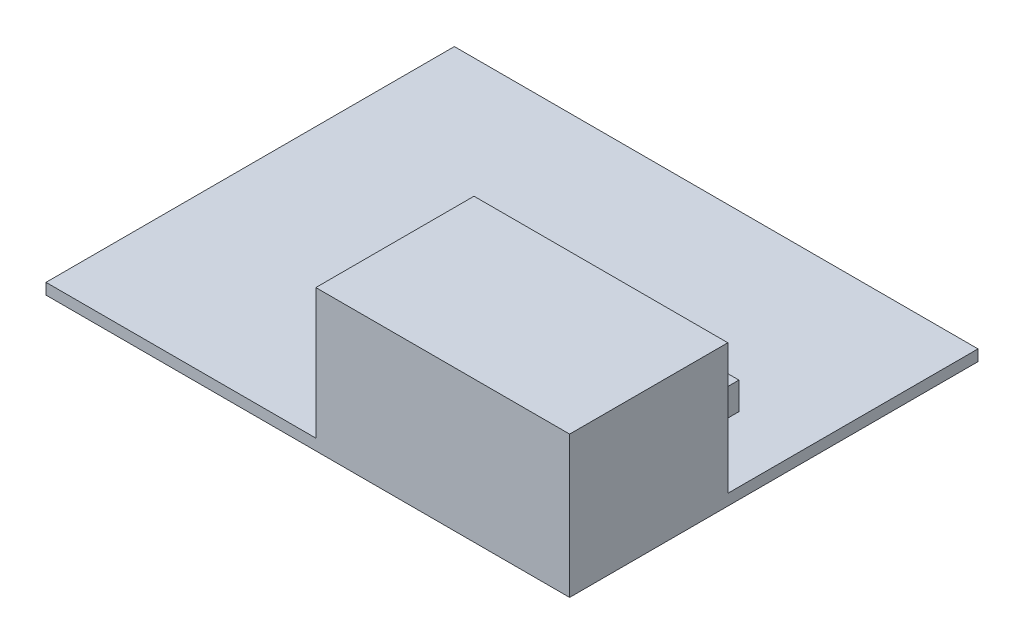
ISO-10303-21;
HEADER;
FILE_DESCRIPTION(('STEP AP214'),'2;1');
FILE_NAME('part.step','',(''),(''),'','','');
FILE_SCHEMA(('AUTOMOTIVE_DESIGN { 1 0 10303 214 1 1 1 1 }'));
ENDSEC;
DATA;
#1=APPLICATION_CONTEXT('core data for automotive mechanical design processes');
#2=APPLICATION_PROTOCOL_DEFINITION('international standard','automotive_design',2000,#1);
#3=PRODUCT_CONTEXT('',#1,'mechanical');
#4=PRODUCT('Part','Part','',(#3));
#5=PRODUCT_RELATED_PRODUCT_CATEGORY('part','',(#4));
#6=PRODUCT_DEFINITION_FORMATION('','',#4);
#7=PRODUCT_DEFINITION_CONTEXT('part definition',#1,'design');
#8=PRODUCT_DEFINITION('design','',#6,#7);
#9=PRODUCT_DEFINITION_SHAPE('','',#8);
#10=(LENGTH_UNIT() NAMED_UNIT(*) SI_UNIT(.MILLI.,.METRE.));
#11=(NAMED_UNIT(*) PLANE_ANGLE_UNIT() SI_UNIT($,.RADIAN.));
#12=(NAMED_UNIT(*) SI_UNIT($,.STERADIAN.) SOLID_ANGLE_UNIT());
#13=UNCERTAINTY_MEASURE_WITH_UNIT(LENGTH_MEASURE(1.E-05),#10,'distance_accuracy_value','');
#14=(GEOMETRIC_REPRESENTATION_CONTEXT(3) GLOBAL_UNCERTAINTY_ASSIGNED_CONTEXT((#13)) GLOBAL_UNIT_ASSIGNED_CONTEXT((#10,
#11,#12)) REPRESENTATION_CONTEXT('',''));
#15=CARTESIAN_POINT('',(0.,0.,0.));
#16=DIRECTION('',(0.,0.,1.));
#17=DIRECTION('',(1.,0.,0.));
#18=AXIS2_PLACEMENT_3D('',#15,#16,#17);
#19=CARTESIAN_POINT('',(0.,1.62,0.));
#20=DIRECTION('',(0.,1.,0.));
#21=DIRECTION('',(0.,0.,1.));
#22=AXIS2_PLACEMENT_3D('',#19,#20,#21);
#23=PLANE('',#22);
#24=DIRECTION('',(0.,0.,1.));
#25=VECTOR('',#24,1.);
#26=CARTESIAN_POINT('',(1.16839999999999,1.62,29.8323));
#27=LINE('',#26,#25);
#28=CARTESIAN_POINT('',(1.16839999999999,1.62,6.71829999999999));
#29=VERTEX_POINT('',#28);
#30=CARTESIAN_POINT('',(1.16839999999999,1.62,29.8323));
#31=VERTEX_POINT('',#30);
#32=EDGE_CURVE('E146',#29,#31,#27,.T.);
#33=ORIENTED_EDGE('',*,*,#32,.F.);
#34=DIRECTION('',(-1.,0.,0.));
#35=VECTOR('',#34,1.);
#36=CARTESIAN_POINT('',(38.2524,1.62,6.71829999999999));
#37=LINE('',#36,#35);
#38=CARTESIAN_POINT('',(38.2524,1.62,6.71829999999999));
#39=VERTEX_POINT('',#38);
#40=EDGE_CURVE('E60',#39,#29,#37,.T.);
#41=ORIENTED_EDGE('',*,*,#40,.F.);
#42=DIRECTION('',(0.,0.,-1.));
#43=VECTOR('',#42,1.);
#44=CARTESIAN_POINT('',(38.2524,1.62,29.8323));
#45=LINE('',#44,#43);
#46=CARTESIAN_POINT('',(38.2524,1.62,-29.8323));
#47=VERTEX_POINT('',#46);
#48=EDGE_CURVE('E190',#39,#47,#45,.T.);
#49=ORIENTED_EDGE('',*,*,#48,.T.);
#50=DIRECTION('',(-1.,0.,0.));
#51=VECTOR('',#50,1.);
#52=CARTESIAN_POINT('',(38.2524,1.62,-29.8323));
#53=LINE('',#52,#51);
#54=CARTESIAN_POINT('',(-38.2524,1.62,-29.8323));
#55=VERTEX_POINT('',#54);
#56=EDGE_CURVE('E193',#47,#55,#53,.T.);
#57=ORIENTED_EDGE('',*,*,#56,.T.);
#58=DIRECTION('',(0.,0.,1.));
#59=VECTOR('',#58,1.);
#60=CARTESIAN_POINT('',(-38.2524,1.62,29.8323));
#61=LINE('',#60,#59);
#62=CARTESIAN_POINT('',(-38.2524,1.62,29.8323));
#63=VERTEX_POINT('',#62);
#64=EDGE_CURVE('E206',#55,#63,#61,.T.);
#65=ORIENTED_EDGE('',*,*,#64,.T.);
#66=DIRECTION('',(1.,0.,0.));
#67=VECTOR('',#66,1.);
#68=CARTESIAN_POINT('',(38.2524,1.62,29.8323));
#69=LINE('',#68,#67);
#70=EDGE_CURVE('E194',#63,#31,#69,.T.);
#71=ORIENTED_EDGE('',*,*,#70,.T.);
#72=EDGE_LOOP('',(#33,#41,#49,#57,#65,#71));
#73=FACE_BOUND('',#72,.T.);
#74=DIRECTION('',(1.,0.,0.));
#75=VECTOR('',#74,1.);
#76=CARTESIAN_POINT('',(28.733800870763,1.62,0.582851763640785));
#77=LINE('',#76,#75);
#78=CARTESIAN_POINT('',(22.3709991292369,1.62,0.582851763640786));
#79=VERTEX_POINT('',#78);
#80=CARTESIAN_POINT('',(28.733800870763,1.62,0.582851763640785));
#81=VERTEX_POINT('',#80);
#82=EDGE_CURVE('E358',#79,#81,#77,.T.);
#83=ORIENTED_EDGE('',*,*,#82,.F.);
#84=DIRECTION('',(0.,0.,1.));
#85=VECTOR('',#84,1.);
#86=CARTESIAN_POINT('',(22.3709991292369,1.62,0.582851763640786));
#87=LINE('',#86,#85);
#88=CARTESIAN_POINT('',(22.3709991292369,1.62,-4.4182517636408));
#89=VERTEX_POINT('',#88);
#90=EDGE_CURVE('E143',#89,#79,#87,.T.);
#91=ORIENTED_EDGE('',*,*,#90,.F.);
#92=DIRECTION('',(-1.,0.,0.));
#93=VECTOR('',#92,1.);
#94=CARTESIAN_POINT('',(28.733800870763,1.62,-4.4182517636408));
#95=LINE('',#94,#93);
#96=CARTESIAN_POINT('',(28.733800870763,1.62,-4.4182517636408));
#97=VERTEX_POINT('',#96);
#98=EDGE_CURVE('E139',#97,#89,#95,.T.);
#99=ORIENTED_EDGE('',*,*,#98,.F.);
#100=DIRECTION('',(0.,0.,-1.));
#101=VECTOR('',#100,1.);
#102=CARTESIAN_POINT('',(28.733800870763,1.62,0.582851763640785));
#103=LINE('',#102,#101);
#104=EDGE_CURVE('E355',#81,#97,#103,.T.);
#105=ORIENTED_EDGE('',*,*,#104,.F.);
#106=EDGE_LOOP('',(#83,#91,#99,#105));
#107=FACE_BOUND('',#106,.T.);
#108=ADVANCED_FACE('F35',(#73,#107),#23,.T.);
#109=CARTESIAN_POINT('',(-38.2524,1.62,29.8323));
#110=DIRECTION('',(1.,0.,0.));
#111=DIRECTION('',(0.,0.,-1.));
#112=AXIS2_PLACEMENT_3D('',#109,#110,#111);
#113=PLANE('',#112);
#114=DIRECTION('',(0.,0.,1.));
#115=VECTOR('',#114,1.);
#116=CARTESIAN_POINT('',(-38.2524,0.,29.8323));
#117=LINE('',#116,#115);
#118=CARTESIAN_POINT('',(-38.2524,0.,-29.8323));
#119=VERTEX_POINT('',#118);
#120=CARTESIAN_POINT('',(-38.2524,0.,29.8323));
#121=VERTEX_POINT('',#120);
#122=EDGE_CURVE('E181',#119,#121,#117,.T.);
#123=ORIENTED_EDGE('',*,*,#122,.T.);
#124=DIRECTION('',(0.,-1.,0.));
#125=VECTOR('',#124,1.);
#126=CARTESIAN_POINT('',(-38.2524,1.62,29.8323));
#127=LINE('',#126,#125);
#128=EDGE_CURVE('E11',#63,#121,#127,.T.);
#129=ORIENTED_EDGE('',*,*,#128,.F.);
#130=ORIENTED_EDGE('',*,*,#64,.F.);
#131=DIRECTION('',(0.,-1.,0.));
#132=VECTOR('',#131,1.);
#133=CARTESIAN_POINT('',(-38.2524,1.62,-29.8323));
#134=LINE('',#133,#132);
#135=EDGE_CURVE('E199',#55,#119,#134,.T.);
#136=ORIENTED_EDGE('',*,*,#135,.T.);
#137=EDGE_LOOP('',(#123,#129,#130,#136));
#138=FACE_BOUND('',#137,.T.);
#139=ADVANCED_FACE('F37',(#138),#113,.F.);
#140=CARTESIAN_POINT('',(38.2524,1.62,29.8323));
#141=DIRECTION('',(0.,0.,-1.));
#142=DIRECTION('',(-1.,0.,0.));
#143=AXIS2_PLACEMENT_3D('',#140,#141,#142);
#144=PLANE('',#143);
#145=DIRECTION('',(1.,0.,0.));
#146=VECTOR('',#145,1.);
#147=CARTESIAN_POINT('',(38.2524,0.,29.8323));
#148=LINE('',#147,#146);
#149=CARTESIAN_POINT('',(38.2524,0.,29.8323));
#150=VERTEX_POINT('',#149);
#151=EDGE_CURVE('E185',#121,#150,#148,.T.);
#152=ORIENTED_EDGE('',*,*,#151,.T.);
#153=DIRECTION('',(0.,-1.,0.));
#154=VECTOR('',#153,1.);
#155=CARTESIAN_POINT('',(38.2524,1.62,29.8323));
#156=LINE('',#155,#154);
#157=CARTESIAN_POINT('',(38.2524,20.67,29.8323));
#158=VERTEX_POINT('',#157);
#159=EDGE_CURVE('E44',#158,#150,#156,.T.);
#160=ORIENTED_EDGE('',*,*,#159,.F.);
#161=DIRECTION('',(1.,0.,0.));
#162=VECTOR('',#161,1.);
#163=CARTESIAN_POINT('',(38.2524,20.67,29.8323));
#164=LINE('',#163,#162);
#165=CARTESIAN_POINT('',(1.16839999999999,20.67,29.8323));
#166=VERTEX_POINT('',#165);
#167=EDGE_CURVE('E158',#166,#158,#164,.T.);
#168=ORIENTED_EDGE('',*,*,#167,.F.);
#169=DIRECTION('',(0.,-1.,0.));
#170=VECTOR('',#169,1.);
#171=CARTESIAN_POINT('',(1.16839999999999,20.67,29.8323));
#172=LINE('',#171,#170);
#173=EDGE_CURVE('E161',#166,#31,#172,.T.);
#174=ORIENTED_EDGE('',*,*,#173,.T.);
#175=ORIENTED_EDGE('',*,*,#70,.F.);
#176=ORIENTED_EDGE('',*,*,#128,.T.);
#177=EDGE_LOOP('',(#152,#160,#168,#174,#175,#176));
#178=FACE_BOUND('',#177,.T.);
#179=ADVANCED_FACE('F232',(#178),#144,.F.);
#180=CARTESIAN_POINT('',(38.2524,1.62,29.8323));
#181=DIRECTION('',(-1.,0.,0.));
#182=DIRECTION('',(0.,0.,1.));
#183=AXIS2_PLACEMENT_3D('',#180,#181,#182);
#184=PLANE('',#183);
#185=DIRECTION('',(0.,0.,-1.));
#186=VECTOR('',#185,1.);
#187=CARTESIAN_POINT('',(38.2524,0.,29.8323));
#188=LINE('',#187,#186);
#189=CARTESIAN_POINT('',(38.2524,0.,-29.8323));
#190=VERTEX_POINT('',#189);
#191=EDGE_CURVE('E202',#150,#190,#188,.T.);
#192=ORIENTED_EDGE('',*,*,#191,.T.);
#193=DIRECTION('',(0.,-1.,0.));
#194=VECTOR('',#193,1.);
#195=CARTESIAN_POINT('',(38.2524,1.62,-29.8323));
#196=LINE('',#195,#194);
#197=EDGE_CURVE('E209',#47,#190,#196,.T.);
#198=ORIENTED_EDGE('',*,*,#197,.F.);
#199=ORIENTED_EDGE('',*,*,#48,.F.);
#200=DIRECTION('',(0.,-1.,0.));
#201=VECTOR('',#200,1.);
#202=CARTESIAN_POINT('',(38.2524,20.67,6.71829999999999));
#203=LINE('',#202,#201);
#204=CARTESIAN_POINT('',(38.2524,20.67,6.71829999999999));
#205=VERTEX_POINT('',#204);
#206=EDGE_CURVE('E176',#205,#39,#203,.T.);
#207=ORIENTED_EDGE('',*,*,#206,.F.);
#208=DIRECTION('',(0.,0.,-1.));
#209=VECTOR('',#208,1.);
#210=CARTESIAN_POINT('',(38.2524,20.67,29.8323));
#211=LINE('',#210,#209);
#212=EDGE_CURVE('E151',#158,#205,#211,.T.);
#213=ORIENTED_EDGE('',*,*,#212,.F.);
#214=ORIENTED_EDGE('',*,*,#159,.T.);
#215=EDGE_LOOP('',(#192,#198,#199,#207,#213,#214));
#216=FACE_BOUND('',#215,.T.);
#217=ADVANCED_FACE('F216',(#216),#184,.F.);
#218=CARTESIAN_POINT('',(38.2524,1.62,-29.8323));
#219=DIRECTION('',(0.,0.,1.));
#220=DIRECTION('',(1.,0.,0.));
#221=AXIS2_PLACEMENT_3D('',#218,#219,#220);
#222=PLANE('',#221);
#223=DIRECTION('',(-1.,0.,0.));
#224=VECTOR('',#223,1.);
#225=CARTESIAN_POINT('',(38.2524,0.,-29.8323));
#226=LINE('',#225,#224);
#227=EDGE_CURVE('E204',#190,#119,#226,.T.);
#228=ORIENTED_EDGE('',*,*,#227,.T.);
#229=ORIENTED_EDGE('',*,*,#135,.F.);
#230=ORIENTED_EDGE('',*,*,#56,.F.);
#231=ORIENTED_EDGE('',*,*,#197,.T.);
#232=EDGE_LOOP('',(#228,#229,#230,#231));
#233=FACE_BOUND('',#232,.T.);
#234=ADVANCED_FACE('F224',(#233),#222,.F.);
#235=CARTESIAN_POINT('',(0.,0.,0.));
#236=DIRECTION('',(0.,1.,0.));
#237=DIRECTION('',(0.,0.,1.));
#238=AXIS2_PLACEMENT_3D('',#235,#236,#237);
#239=PLANE('',#238);
#240=ORIENTED_EDGE('',*,*,#122,.F.);
#241=ORIENTED_EDGE('',*,*,#227,.F.);
#242=ORIENTED_EDGE('',*,*,#191,.F.);
#243=ORIENTED_EDGE('',*,*,#151,.F.);
#244=EDGE_LOOP('',(#240,#241,#242,#243));
#245=FACE_BOUND('',#244,.T.);
#246=ADVANCED_FACE('F221',(#245),#239,.F.);
#247=CARTESIAN_POINT('',(38.2524,20.67,6.71829999999999));
#248=DIRECTION('',(0.,0.,1.));
#249=DIRECTION('',(1.,0.,0.));
#250=AXIS2_PLACEMENT_3D('',#247,#248,#249);
#251=PLANE('',#250);
#252=ORIENTED_EDGE('',*,*,#40,.T.);
#253=DIRECTION('',(0.,-1.,0.));
#254=VECTOR('',#253,1.);
#255=CARTESIAN_POINT('',(1.16839999999999,20.67,6.71829999999999));
#256=LINE('',#255,#254);
#257=CARTESIAN_POINT('',(1.16839999999999,20.67,6.71829999999999));
#258=VERTEX_POINT('',#257);
#259=EDGE_CURVE('E164',#258,#29,#256,.T.);
#260=ORIENTED_EDGE('',*,*,#259,.F.);
#261=DIRECTION('',(-1.,0.,0.));
#262=VECTOR('',#261,1.);
#263=CARTESIAN_POINT('',(38.2524,20.67,6.71829999999999));
#264=LINE('',#263,#262);
#265=EDGE_CURVE('E154',#205,#258,#264,.T.);
#266=ORIENTED_EDGE('',*,*,#265,.F.);
#267=ORIENTED_EDGE('',*,*,#206,.T.);
#268=EDGE_LOOP('',(#252,#260,#266,#267));
#269=FACE_BOUND('',#268,.T.);
#270=ADVANCED_FACE('F235',(#269),#251,.F.);
#271=CARTESIAN_POINT('',(1.16839999999999,20.67,29.8323));
#272=DIRECTION('',(1.,0.,0.));
#273=DIRECTION('',(0.,0.,-1.));
#274=AXIS2_PLACEMENT_3D('',#271,#272,#273);
#275=PLANE('',#274);
#276=ORIENTED_EDGE('',*,*,#32,.T.);
#277=ORIENTED_EDGE('',*,*,#173,.F.);
#278=DIRECTION('',(0.,0.,1.));
#279=VECTOR('',#278,1.);
#280=CARTESIAN_POINT('',(1.16839999999999,20.67,29.8323));
#281=LINE('',#280,#279);
#282=EDGE_CURVE('E156',#258,#166,#281,.T.);
#283=ORIENTED_EDGE('',*,*,#282,.F.);
#284=ORIENTED_EDGE('',*,*,#259,.T.);
#285=EDGE_LOOP('',(#276,#277,#283,#284));
#286=FACE_BOUND('',#285,.T.);
#287=ADVANCED_FACE('F231',(#286),#275,.F.);
#288=CARTESIAN_POINT('',(0.,20.67,0.));
#289=DIRECTION('',(0.,1.,0.));
#290=DIRECTION('',(0.,0.,1.));
#291=AXIS2_PLACEMENT_3D('',#288,#289,#290);
#292=PLANE('',#291);
#293=ORIENTED_EDGE('',*,*,#212,.T.);
#294=ORIENTED_EDGE('',*,*,#265,.T.);
#295=ORIENTED_EDGE('',*,*,#282,.T.);
#296=ORIENTED_EDGE('',*,*,#167,.T.);
#297=EDGE_LOOP('',(#293,#294,#295,#296));
#298=FACE_BOUND('',#297,.T.);
#299=ADVANCED_FACE('F234',(#298),#292,.T.);
#300=CARTESIAN_POINT('',(22.3709991292369,5.62,0.582851763640786));
#301=DIRECTION('',(1.,0.,0.));
#302=DIRECTION('',(0.,0.,-1.));
#303=AXIS2_PLACEMENT_3D('',#300,#301,#302);
#304=PLANE('',#303);
#305=ORIENTED_EDGE('',*,*,#90,.T.);
#306=DIRECTION('',(0.,-1.,0.));
#307=VECTOR('',#306,1.);
#308=CARTESIAN_POINT('',(22.3709991292369,5.62,0.582851763640786));
#309=LINE('',#308,#307);
#310=CARTESIAN_POINT('',(22.3709991292369,5.62,0.582851763640786));
#311=VERTEX_POINT('',#310);
#312=EDGE_CURVE('E124',#311,#79,#309,.T.);
#313=ORIENTED_EDGE('',*,*,#312,.F.);
#314=DIRECTION('',(0.,0.,1.));
#315=VECTOR('',#314,1.);
#316=CARTESIAN_POINT('',(22.3709991292369,5.62,0.582851763640786));
#317=LINE('',#316,#315);
#318=CARTESIAN_POINT('',(22.3709991292369,5.62,-4.4182517636408));
#319=VERTEX_POINT('',#318);
#320=EDGE_CURVE('E131',#319,#311,#317,.T.);
#321=ORIENTED_EDGE('',*,*,#320,.F.);
#322=DIRECTION('',(0.,-1.,0.));
#323=VECTOR('',#322,1.);
#324=CARTESIAN_POINT('',(22.3709991292369,5.62,-4.4182517636408));
#325=LINE('',#324,#323);
#326=EDGE_CURVE('E353',#319,#89,#325,.T.);
#327=ORIENTED_EDGE('',*,*,#326,.T.);
#328=EDGE_LOOP('',(#305,#313,#321,#327));
#329=FACE_BOUND('',#328,.T.);
#330=ADVANCED_FACE('F141',(#329),#304,.F.);
#331=CARTESIAN_POINT('',(28.733800870763,5.62,0.582851763640785));
#332=DIRECTION('',(0.,0.,-1.));
#333=DIRECTION('',(-1.,0.,0.));
#334=AXIS2_PLACEMENT_3D('',#331,#332,#333);
#335=PLANE('',#334);
#336=ORIENTED_EDGE('',*,*,#82,.T.);
#337=DIRECTION('',(0.,-1.,0.));
#338=VECTOR('',#337,1.);
#339=CARTESIAN_POINT('',(28.733800870763,5.62,0.582851763640785));
#340=LINE('',#339,#338);
#341=CARTESIAN_POINT('',(28.733800870763,5.62,0.582851763640785));
#342=VERTEX_POINT('',#341);
#343=EDGE_CURVE('E127',#342,#81,#340,.T.);
#344=ORIENTED_EDGE('',*,*,#343,.F.);
#345=DIRECTION('',(1.,0.,0.));
#346=VECTOR('',#345,1.);
#347=CARTESIAN_POINT('',(28.733800870763,5.62,0.582851763640785));
#348=LINE('',#347,#346);
#349=EDGE_CURVE('E120',#311,#342,#348,.T.);
#350=ORIENTED_EDGE('',*,*,#349,.F.);
#351=ORIENTED_EDGE('',*,*,#312,.T.);
#352=EDGE_LOOP('',(#336,#344,#350,#351));
#353=FACE_BOUND('',#352,.T.);
#354=ADVANCED_FACE('F122',(#353),#335,.F.);
#355=CARTESIAN_POINT('',(28.733800870763,5.62,0.582851763640785));
#356=DIRECTION('',(-1.,0.,0.));
#357=DIRECTION('',(0.,0.,1.));
#358=AXIS2_PLACEMENT_3D('',#355,#356,#357);
#359=PLANE('',#358);
#360=ORIENTED_EDGE('',*,*,#104,.T.);
#361=DIRECTION('',(0.,-1.,0.));
#362=VECTOR('',#361,1.);
#363=CARTESIAN_POINT('',(28.733800870763,5.62,-4.4182517636408));
#364=LINE('',#363,#362);
#365=CARTESIAN_POINT('',(28.733800870763,5.62,-4.4182517636408));
#366=VERTEX_POINT('',#365);
#367=EDGE_CURVE('E52',#366,#97,#364,.T.);
#368=ORIENTED_EDGE('',*,*,#367,.F.);
#369=DIRECTION('',(0.,0.,-1.));
#370=VECTOR('',#369,1.);
#371=CARTESIAN_POINT('',(28.733800870763,5.62,0.582851763640785));
#372=LINE('',#371,#370);
#373=EDGE_CURVE('E130',#342,#366,#372,.T.);
#374=ORIENTED_EDGE('',*,*,#373,.F.);
#375=ORIENTED_EDGE('',*,*,#343,.T.);
#376=EDGE_LOOP('',(#360,#368,#374,#375));
#377=FACE_BOUND('',#376,.T.);
#378=ADVANCED_FACE('F320',(#377),#359,.F.);
#379=CARTESIAN_POINT('',(28.733800870763,5.62,-4.4182517636408));
#380=DIRECTION('',(0.,0.,1.));
#381=DIRECTION('',(1.,0.,0.));
#382=AXIS2_PLACEMENT_3D('',#379,#380,#381);
#383=PLANE('',#382);
#384=ORIENTED_EDGE('',*,*,#98,.T.);
#385=ORIENTED_EDGE('',*,*,#326,.F.);
#386=DIRECTION('',(-1.,0.,0.));
#387=VECTOR('',#386,1.);
#388=CARTESIAN_POINT('',(28.733800870763,5.62,-4.4182517636408));
#389=LINE('',#388,#387);
#390=EDGE_CURVE('E135',#366,#319,#389,.T.);
#391=ORIENTED_EDGE('',*,*,#390,.F.);
#392=ORIENTED_EDGE('',*,*,#367,.T.);
#393=EDGE_LOOP('',(#384,#385,#391,#392));
#394=FACE_BOUND('',#393,.T.);
#395=ADVANCED_FACE('F328',(#394),#383,.F.);
#396=CARTESIAN_POINT('',(0.,5.62,0.));
#397=DIRECTION('',(0.,1.,0.));
#398=DIRECTION('',(0.,0.,1.));
#399=AXIS2_PLACEMENT_3D('',#396,#397,#398);
#400=PLANE('',#399);
#401=ORIENTED_EDGE('',*,*,#320,.T.);
#402=ORIENTED_EDGE('',*,*,#349,.T.);
#403=ORIENTED_EDGE('',*,*,#373,.T.);
#404=ORIENTED_EDGE('',*,*,#390,.T.);
#405=EDGE_LOOP('',(#401,#402,#403,#404));
#406=FACE_BOUND('',#405,.T.);
#407=ADVANCED_FACE('F134',(#406),#400,.T.);
#408=CLOSED_SHELL('',(#108,#139,#179,#217,#234,#246,#270,#287,#299,#330,#354,#378,#395,#407));
#409=MANIFOLD_SOLID_BREP('B2',#408);
#410=ADVANCED_BREP_SHAPE_REPRESENTATION('',(#18,#409),#14);
#411=SHAPE_DEFINITION_REPRESENTATION(#9,#410);
ENDSEC;
END-ISO-10303-21;
